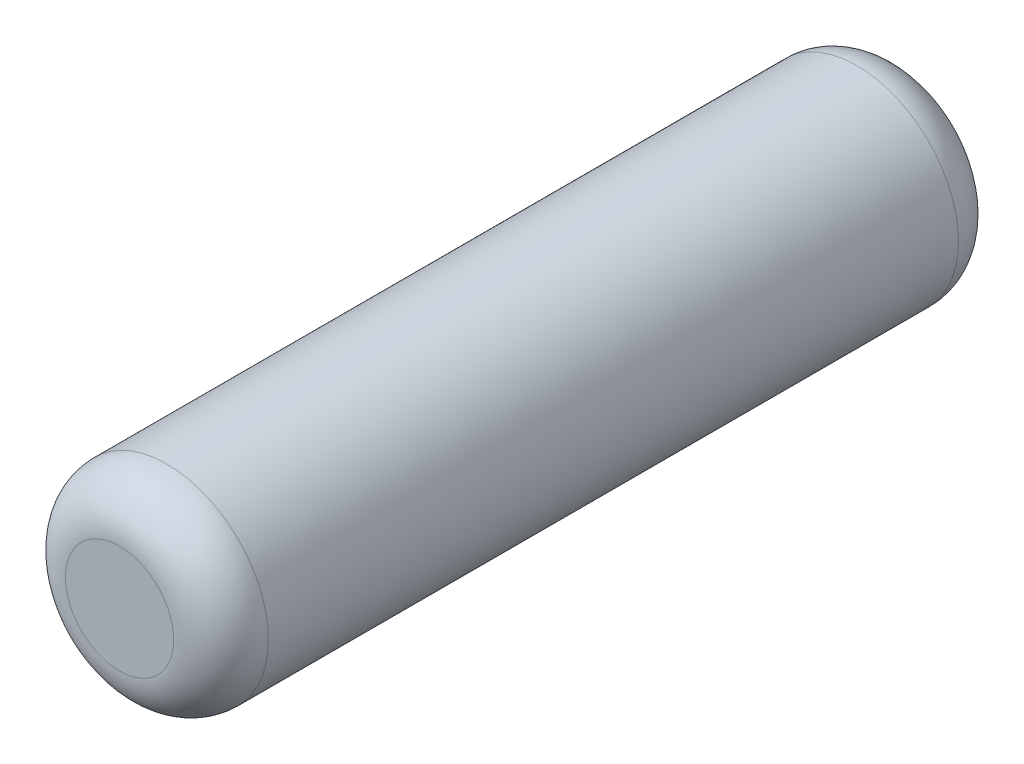
ISO-10303-21;
HEADER;
FILE_DESCRIPTION(('STEP AP214'),'2;1');
FILE_NAME('part.step','',(''),(''),'','','');
FILE_SCHEMA(('AUTOMOTIVE_DESIGN { 1 0 10303 214 1 1 1 1 }'));
ENDSEC;
DATA;
#1=APPLICATION_CONTEXT('core data for automotive mechanical design processes');
#2=APPLICATION_PROTOCOL_DEFINITION('international standard','automotive_design',2000,#1);
#3=PRODUCT_CONTEXT('',#1,'mechanical');
#4=PRODUCT('Part','Part','',(#3));
#5=PRODUCT_RELATED_PRODUCT_CATEGORY('part','',(#4));
#6=PRODUCT_DEFINITION_FORMATION('','',#4);
#7=PRODUCT_DEFINITION_CONTEXT('part definition',#1,'design');
#8=PRODUCT_DEFINITION('design','',#6,#7);
#9=PRODUCT_DEFINITION_SHAPE('','',#8);
#10=(LENGTH_UNIT() NAMED_UNIT(*) SI_UNIT(.MILLI.,.METRE.));
#11=(NAMED_UNIT(*) PLANE_ANGLE_UNIT() SI_UNIT($,.RADIAN.));
#12=(NAMED_UNIT(*) SI_UNIT($,.STERADIAN.) SOLID_ANGLE_UNIT());
#13=UNCERTAINTY_MEASURE_WITH_UNIT(LENGTH_MEASURE(1.E-05),#10,'distance_accuracy_value','');
#14=(GEOMETRIC_REPRESENTATION_CONTEXT(3) GLOBAL_UNCERTAINTY_ASSIGNED_CONTEXT((#13)) GLOBAL_UNIT_ASSIGNED_CONTEXT((#10,
#11,#12)) REPRESENTATION_CONTEXT('',''));
#15=CARTESIAN_POINT('',(0.,0.,0.));
#16=DIRECTION('',(0.,0.,1.));
#17=DIRECTION('',(1.,0.,0.));
#18=AXIS2_PLACEMENT_3D('',#15,#16,#17);
#19=CARTESIAN_POINT('',(0.,0.,2.9));
#20=DIRECTION('',(0.,0.,-1.));
#21=DIRECTION('',(-1.,0.,0.));
#22=AXIS2_PLACEMENT_3D('',#19,#20,#21);
#23=CYLINDRICAL_SURFACE('',#22,0.75);
#24=CARTESIAN_POINT('',(0.,0.,-2.55));
#25=DIRECTION('',(0.,0.,1.));
#26=DIRECTION('',(1.,0.,0.));
#27=AXIS2_PLACEMENT_3D('',#24,#25,#26);
#28=CIRCLE('',#27,0.75);
#29=CARTESIAN_POINT('',(0.75,0.,-2.55));
#30=VERTEX_POINT('',#29);
#31=EDGE_CURVE('E42',#30,#30,#28,.T.);
#32=ORIENTED_EDGE('',*,*,#31,.T.);
#33=EDGE_LOOP('',(#32));
#34=FACE_BOUND('',#33,.T.);
#35=CARTESIAN_POINT('',(0.,0.,2.55));
#36=DIRECTION('',(0.,0.,1.));
#37=DIRECTION('',(1.,0.,0.));
#38=AXIS2_PLACEMENT_3D('',#35,#36,#37);
#39=CIRCLE('',#38,0.75);
#40=CARTESIAN_POINT('',(0.75,0.,2.55));
#41=VERTEX_POINT('',#40);
#42=EDGE_CURVE('E46',#41,#41,#39,.F.);
#43=ORIENTED_EDGE('',*,*,#42,.T.);
#44=EDGE_LOOP('',(#43));
#45=FACE_BOUND('',#44,.T.);
#46=ADVANCED_FACE('F31',(#34,#45),#23,.T.);
#47=CARTESIAN_POINT('',(0.,0.,2.9));
#48=DIRECTION('',(0.,0.,1.));
#49=DIRECTION('',(1.,0.,0.));
#50=AXIS2_PLACEMENT_3D('',#47,#48,#49);
#51=PLANE('',#50);
#52=CARTESIAN_POINT('',(0.,0.,2.9));
#53=DIRECTION('',(0.,0.,1.));
#54=DIRECTION('',(1.,0.,0.));
#55=AXIS2_PLACEMENT_3D('',#52,#53,#54);
#56=CIRCLE('',#55,0.4);
#57=CARTESIAN_POINT('',(0.4,0.,2.9));
#58=VERTEX_POINT('',#57);
#59=EDGE_CURVE('E10',#58,#58,#56,.T.);
#60=ORIENTED_EDGE('',*,*,#59,.T.);
#61=EDGE_LOOP('',(#60));
#62=FACE_BOUND('',#61,.T.);
#63=ADVANCED_FACE('F62',(#62),#51,.T.);
#64=CARTESIAN_POINT('',(0.,0.,-2.9));
#65=DIRECTION('',(0.,0.,1.));
#66=DIRECTION('',(1.,0.,0.));
#67=AXIS2_PLACEMENT_3D('',#64,#65,#66);
#68=PLANE('',#67);
#69=CARTESIAN_POINT('',(0.,0.,-2.9));
#70=DIRECTION('',(0.,0.,1.));
#71=DIRECTION('',(1.,0.,0.));
#72=AXIS2_PLACEMENT_3D('',#69,#70,#71);
#73=CIRCLE('',#72,0.4);
#74=CARTESIAN_POINT('',(0.4,0.,-2.9));
#75=VERTEX_POINT('',#74);
#76=EDGE_CURVE('E38',#75,#75,#73,.F.);
#77=ORIENTED_EDGE('',*,*,#76,.T.);
#78=EDGE_LOOP('',(#77));
#79=FACE_BOUND('',#78,.T.);
#80=ADVANCED_FACE('F59',(#79),#68,.F.);
#81=CARTESIAN_POINT('',(0.,0.,-2.55));
#82=DIRECTION('',(0.,0.,1.));
#83=DIRECTION('',(1.,0.,0.));
#84=AXIS2_PLACEMENT_3D('',#81,#82,#83);
#85=TOROIDAL_SURFACE('',#84,0.4,0.35);
#86=ORIENTED_EDGE('',*,*,#76,.F.);
#87=EDGE_LOOP('',(#86));
#88=FACE_BOUND('',#87,.T.);
#89=ORIENTED_EDGE('',*,*,#31,.F.);
#90=EDGE_LOOP('',(#89));
#91=FACE_BOUND('',#90,.T.);
#92=ADVANCED_FACE('F55',(#88,#91),#85,.T.);
#93=CARTESIAN_POINT('',(0.,0.,2.55));
#94=DIRECTION('',(0.,0.,1.));
#95=DIRECTION('',(1.,0.,0.));
#96=AXIS2_PLACEMENT_3D('',#93,#94,#95);
#97=TOROIDAL_SURFACE('',#96,0.4,0.35);
#98=ORIENTED_EDGE('',*,*,#42,.F.);
#99=EDGE_LOOP('',(#98));
#100=FACE_BOUND('',#99,.T.);
#101=ORIENTED_EDGE('',*,*,#59,.F.);
#102=EDGE_LOOP('',(#101));
#103=FACE_BOUND('',#102,.T.);
#104=ADVANCED_FACE('F33',(#100,#103),#97,.T.);
#105=CLOSED_SHELL('',(#46,#63,#80,#92,#104));
#106=MANIFOLD_SOLID_BREP('B2',#105);
#107=ADVANCED_BREP_SHAPE_REPRESENTATION('',(#18,#106),#14);
#108=SHAPE_DEFINITION_REPRESENTATION(#9,#107);
ENDSEC;
END-ISO-10303-21;
